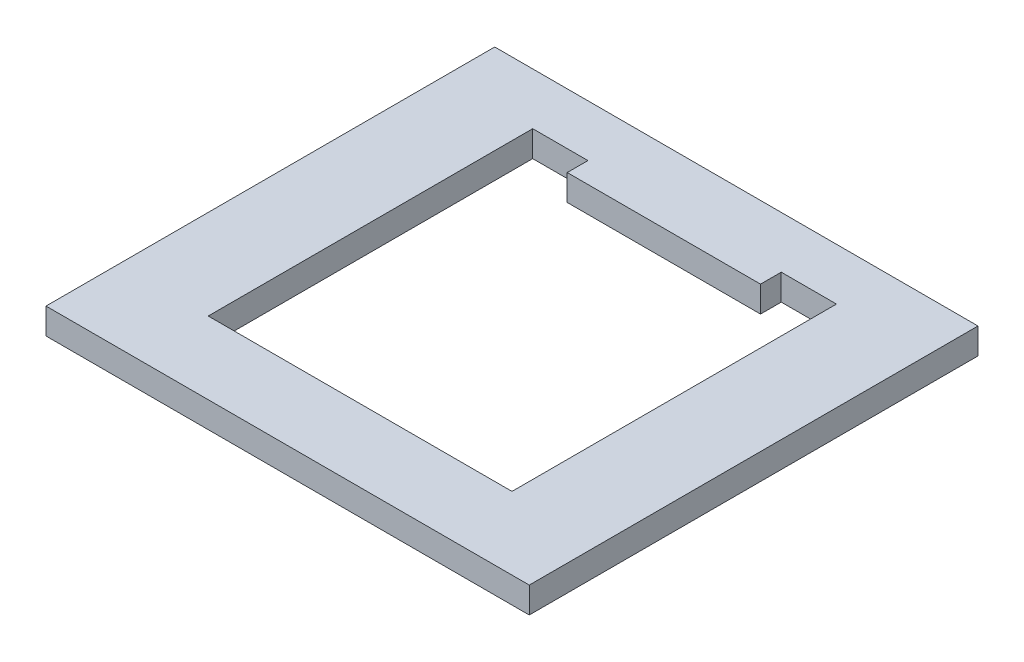
ISO-10303-21;
HEADER;
FILE_DESCRIPTION(('STEP AP214'),'2;1');
FILE_NAME('part.step','',(''),(''),'','','');
FILE_SCHEMA(('AUTOMOTIVE_DESIGN { 1 0 10303 214 1 1 1 1 }'));
ENDSEC;
DATA;
#1=APPLICATION_CONTEXT('core data for automotive mechanical design processes');
#2=APPLICATION_PROTOCOL_DEFINITION('international standard','automotive_design',2000,#1);
#3=PRODUCT_CONTEXT('',#1,'mechanical');
#4=PRODUCT('Part','Part','',(#3));
#5=PRODUCT_RELATED_PRODUCT_CATEGORY('part','',(#4));
#6=PRODUCT_DEFINITION_FORMATION('','',#4);
#7=PRODUCT_DEFINITION_CONTEXT('part definition',#1,'design');
#8=PRODUCT_DEFINITION('design','',#6,#7);
#9=PRODUCT_DEFINITION_SHAPE('','',#8);
#10=(LENGTH_UNIT() NAMED_UNIT(*) SI_UNIT(.MILLI.,.METRE.));
#11=(NAMED_UNIT(*) PLANE_ANGLE_UNIT() SI_UNIT($,.RADIAN.));
#12=(NAMED_UNIT(*) SI_UNIT($,.STERADIAN.) SOLID_ANGLE_UNIT());
#13=UNCERTAINTY_MEASURE_WITH_UNIT(LENGTH_MEASURE(1.E-05),#10,'distance_accuracy_value','');
#14=(GEOMETRIC_REPRESENTATION_CONTEXT(3) GLOBAL_UNCERTAINTY_ASSIGNED_CONTEXT((#13)) GLOBAL_UNIT_ASSIGNED_CONTEXT((#10,
#11,#12)) REPRESENTATION_CONTEXT('',''));
#15=CARTESIAN_POINT('',(0.,0.,0.));
#16=DIRECTION('',(0.,0.,1.));
#17=DIRECTION('',(1.,0.,0.));
#18=AXIS2_PLACEMENT_3D('',#15,#16,#17);
#19=CARTESIAN_POINT('',(35.,3.76,0.));
#20=DIRECTION('',(1.,0.,0.));
#21=DIRECTION('',(0.,0.,-1.));
#22=AXIS2_PLACEMENT_3D('',#19,#20,#21);
#23=PLANE('',#22);
#24=DIRECTION('',(0.,0.,1.));
#25=VECTOR('',#24,1.);
#26=CARTESIAN_POINT('',(35.,0.,0.));
#27=LINE('',#26,#25);
#28=CARTESIAN_POINT('',(35.,0.,-32.5));
#29=VERTEX_POINT('',#28);
#30=CARTESIAN_POINT('',(35.,0.,32.5));
#31=VERTEX_POINT('',#30);
#32=EDGE_CURVE('E184',#29,#31,#27,.T.);
#33=ORIENTED_EDGE('',*,*,#32,.F.);
#34=DIRECTION('',(0.,-1.,0.));
#35=VECTOR('',#34,1.);
#36=CARTESIAN_POINT('',(35.,3.76,-32.5));
#37=LINE('',#36,#35);
#38=CARTESIAN_POINT('',(35.,3.76,-32.5));
#39=VERTEX_POINT('',#38);
#40=EDGE_CURVE('E11',#39,#29,#37,.T.);
#41=ORIENTED_EDGE('',*,*,#40,.F.);
#42=DIRECTION('',(0.,0.,1.));
#43=VECTOR('',#42,1.);
#44=CARTESIAN_POINT('',(35.,3.76,0.));
#45=LINE('',#44,#43);
#46=CARTESIAN_POINT('',(35.,3.76,32.5));
#47=VERTEX_POINT('',#46);
#48=EDGE_CURVE('E154',#39,#47,#45,.T.);
#49=ORIENTED_EDGE('',*,*,#48,.T.);
#50=DIRECTION('',(0.,-1.,0.));
#51=VECTOR('',#50,1.);
#52=CARTESIAN_POINT('',(35.,3.76,32.5));
#53=LINE('',#52,#51);
#54=EDGE_CURVE('E104',#47,#31,#53,.T.);
#55=ORIENTED_EDGE('',*,*,#54,.T.);
#56=EDGE_LOOP('',(#33,#41,#49,#55));
#57=FACE_BOUND('',#56,.T.);
#58=ADVANCED_FACE('F38',(#57),#23,.T.);
#59=CARTESIAN_POINT('',(0.,3.76,-32.5));
#60=DIRECTION('',(0.,0.,-1.));
#61=DIRECTION('',(-1.,0.,0.));
#62=AXIS2_PLACEMENT_3D('',#59,#60,#61);
#63=PLANE('',#62);
#64=DIRECTION('',(1.,0.,0.));
#65=VECTOR('',#64,1.);
#66=CARTESIAN_POINT('',(0.,0.,-32.5));
#67=LINE('',#66,#65);
#68=CARTESIAN_POINT('',(-35.,0.,-32.5));
#69=VERTEX_POINT('',#68);
#70=EDGE_CURVE('E144',#69,#29,#67,.T.);
#71=ORIENTED_EDGE('',*,*,#70,.F.);
#72=DIRECTION('',(0.,-1.,0.));
#73=VECTOR('',#72,1.);
#74=CARTESIAN_POINT('',(-35.,3.76,-32.5));
#75=LINE('',#74,#73);
#76=CARTESIAN_POINT('',(-35.,3.76,-32.5));
#77=VERTEX_POINT('',#76);
#78=EDGE_CURVE('E48',#77,#69,#75,.T.);
#79=ORIENTED_EDGE('',*,*,#78,.F.);
#80=DIRECTION('',(1.,0.,0.));
#81=VECTOR('',#80,1.);
#82=CARTESIAN_POINT('',(0.,3.76,-32.5));
#83=LINE('',#82,#81);
#84=EDGE_CURVE('E142',#77,#39,#83,.T.);
#85=ORIENTED_EDGE('',*,*,#84,.T.);
#86=ORIENTED_EDGE('',*,*,#40,.T.);
#87=EDGE_LOOP('',(#71,#79,#85,#86));
#88=FACE_BOUND('',#87,.T.);
#89=ADVANCED_FACE('F140',(#88),#63,.T.);
#90=CARTESIAN_POINT('',(-35.,3.76,0.));
#91=DIRECTION('',(1.,0.,0.));
#92=DIRECTION('',(0.,0.,-1.));
#93=AXIS2_PLACEMENT_3D('',#90,#91,#92);
#94=PLANE('',#93);
#95=DIRECTION('',(0.,0.,1.));
#96=VECTOR('',#95,1.);
#97=CARTESIAN_POINT('',(-35.,0.,0.));
#98=LINE('',#97,#96);
#99=CARTESIAN_POINT('',(-35.,0.,32.5));
#100=VERTEX_POINT('',#99);
#101=EDGE_CURVE('E187',#69,#100,#98,.T.);
#102=ORIENTED_EDGE('',*,*,#101,.T.);
#103=DIRECTION('',(0.,-1.,0.));
#104=VECTOR('',#103,1.);
#105=CARTESIAN_POINT('',(-35.,3.76,32.5));
#106=LINE('',#105,#104);
#107=CARTESIAN_POINT('',(-35.,3.76,32.5));
#108=VERTEX_POINT('',#107);
#109=EDGE_CURVE('E147',#108,#100,#106,.T.);
#110=ORIENTED_EDGE('',*,*,#109,.F.);
#111=DIRECTION('',(0.,0.,1.));
#112=VECTOR('',#111,1.);
#113=CARTESIAN_POINT('',(-35.,3.76,0.));
#114=LINE('',#113,#112);
#115=EDGE_CURVE('E150',#77,#108,#114,.T.);
#116=ORIENTED_EDGE('',*,*,#115,.F.);
#117=ORIENTED_EDGE('',*,*,#78,.T.);
#118=EDGE_LOOP('',(#102,#110,#116,#117));
#119=FACE_BOUND('',#118,.T.);
#120=ADVANCED_FACE('F151',(#119),#94,.F.);
#121=CARTESIAN_POINT('',(14.,3.76,0.));
#122=DIRECTION('',(1.,0.,0.));
#123=DIRECTION('',(0.,0.,-1.));
#124=AXIS2_PLACEMENT_3D('',#121,#122,#123);
#125=PLANE('',#124);
#126=DIRECTION('',(0.,0.,1.));
#127=VECTOR('',#126,1.);
#128=CARTESIAN_POINT('',(14.,0.,0.));
#129=LINE('',#128,#127);
#130=CARTESIAN_POINT('',(14.,0.,-25.));
#131=VERTEX_POINT('',#130);
#132=CARTESIAN_POINT('',(14.,0.,-22.));
#133=VERTEX_POINT('',#132);
#134=EDGE_CURVE('E162',#131,#133,#129,.T.);
#135=ORIENTED_EDGE('',*,*,#134,.F.);
#136=DIRECTION('',(0.,-1.,0.));
#137=VECTOR('',#136,1.);
#138=CARTESIAN_POINT('',(14.,3.76,-25.));
#139=LINE('',#138,#137);
#140=CARTESIAN_POINT('',(14.,3.76,-25.));
#141=VERTEX_POINT('',#140);
#142=EDGE_CURVE('E42',#141,#131,#139,.T.);
#143=ORIENTED_EDGE('',*,*,#142,.F.);
#144=DIRECTION('',(0.,0.,1.));
#145=VECTOR('',#144,1.);
#146=CARTESIAN_POINT('',(14.,3.76,0.));
#147=LINE('',#146,#145);
#148=CARTESIAN_POINT('',(14.,3.76,-22.));
#149=VERTEX_POINT('',#148);
#150=EDGE_CURVE('E190',#141,#149,#147,.T.);
#151=ORIENTED_EDGE('',*,*,#150,.T.);
#152=DIRECTION('',(0.,-1.,0.));
#153=VECTOR('',#152,1.);
#154=CARTESIAN_POINT('',(14.,3.76,-22.));
#155=LINE('',#154,#153);
#156=EDGE_CURVE('E161',#149,#133,#155,.T.);
#157=ORIENTED_EDGE('',*,*,#156,.T.);
#158=EDGE_LOOP('',(#135,#143,#151,#157));
#159=FACE_BOUND('',#158,.T.);
#160=ADVANCED_FACE('F40',(#159),#125,.T.);
#161=CARTESIAN_POINT('',(0.,3.76,-25.));
#162=DIRECTION('',(0.,0.,1.));
#163=DIRECTION('',(1.,0.,0.));
#164=AXIS2_PLACEMENT_3D('',#161,#162,#163);
#165=PLANE('',#164);
#166=DIRECTION('',(-1.,0.,0.));
#167=VECTOR('',#166,1.);
#168=CARTESIAN_POINT('',(0.,0.,-25.));
#169=LINE('',#168,#167);
#170=CARTESIAN_POINT('',(22.,0.,-25.));
#171=VERTEX_POINT('',#170);
#172=EDGE_CURVE('E165',#171,#131,#169,.T.);
#173=ORIENTED_EDGE('',*,*,#172,.F.);
#174=DIRECTION('',(0.,-1.,0.));
#175=VECTOR('',#174,1.);
#176=CARTESIAN_POINT('',(22.,3.76,-25.));
#177=LINE('',#176,#175);
#178=CARTESIAN_POINT('',(22.,3.76,-25.));
#179=VERTEX_POINT('',#178);
#180=EDGE_CURVE('E205',#179,#171,#177,.T.);
#181=ORIENTED_EDGE('',*,*,#180,.F.);
#182=DIRECTION('',(-1.,0.,0.));
#183=VECTOR('',#182,1.);
#184=CARTESIAN_POINT('',(0.,3.76,-25.));
#185=LINE('',#184,#183);
#186=EDGE_CURVE('E214',#179,#141,#185,.T.);
#187=ORIENTED_EDGE('',*,*,#186,.T.);
#188=ORIENTED_EDGE('',*,*,#142,.T.);
#189=EDGE_LOOP('',(#173,#181,#187,#188));
#190=FACE_BOUND('',#189,.T.);
#191=ADVANCED_FACE('F212',(#190),#165,.T.);
#192=CARTESIAN_POINT('',(22.,3.76,0.));
#193=DIRECTION('',(-1.,0.,0.));
#194=DIRECTION('',(0.,0.,1.));
#195=AXIS2_PLACEMENT_3D('',#192,#193,#194);
#196=PLANE('',#195);
#197=DIRECTION('',(0.,0.,-1.));
#198=VECTOR('',#197,1.);
#199=CARTESIAN_POINT('',(22.,0.,0.));
#200=LINE('',#199,#198);
#201=CARTESIAN_POINT('',(22.,0.,22.));
#202=VERTEX_POINT('',#201);
#203=EDGE_CURVE('E168',#202,#171,#200,.T.);
#204=ORIENTED_EDGE('',*,*,#203,.F.);
#205=DIRECTION('',(0.,-1.,0.));
#206=VECTOR('',#205,1.);
#207=CARTESIAN_POINT('',(22.,3.76,22.));
#208=LINE('',#207,#206);
#209=CARTESIAN_POINT('',(22.,3.76,22.));
#210=VERTEX_POINT('',#209);
#211=EDGE_CURVE('E204',#210,#202,#208,.T.);
#212=ORIENTED_EDGE('',*,*,#211,.F.);
#213=DIRECTION('',(0.,0.,-1.));
#214=VECTOR('',#213,1.);
#215=CARTESIAN_POINT('',(22.,3.76,0.));
#216=LINE('',#215,#214);
#217=EDGE_CURVE('E222',#210,#179,#216,.T.);
#218=ORIENTED_EDGE('',*,*,#217,.T.);
#219=ORIENTED_EDGE('',*,*,#180,.T.);
#220=EDGE_LOOP('',(#204,#212,#218,#219));
#221=FACE_BOUND('',#220,.T.);
#222=ADVANCED_FACE('F220',(#221),#196,.T.);
#223=CARTESIAN_POINT('',(0.,3.76,22.));
#224=DIRECTION('',(0.,0.,-1.));
#225=DIRECTION('',(-1.,0.,0.));
#226=AXIS2_PLACEMENT_3D('',#223,#224,#225);
#227=PLANE('',#226);
#228=DIRECTION('',(1.,0.,0.));
#229=VECTOR('',#228,1.);
#230=CARTESIAN_POINT('',(0.,0.,22.));
#231=LINE('',#230,#229);
#232=CARTESIAN_POINT('',(-22.,0.,22.));
#233=VERTEX_POINT('',#232);
#234=EDGE_CURVE('E171',#233,#202,#231,.T.);
#235=ORIENTED_EDGE('',*,*,#234,.F.);
#236=DIRECTION('',(0.,-1.,0.));
#237=VECTOR('',#236,1.);
#238=CARTESIAN_POINT('',(-22.,3.76,22.));
#239=LINE('',#238,#237);
#240=CARTESIAN_POINT('',(-22.,3.76,22.));
#241=VERTEX_POINT('',#240);
#242=EDGE_CURVE('E202',#241,#233,#239,.T.);
#243=ORIENTED_EDGE('',*,*,#242,.F.);
#244=DIRECTION('',(1.,0.,0.));
#245=VECTOR('',#244,1.);
#246=CARTESIAN_POINT('',(0.,3.76,22.));
#247=LINE('',#246,#245);
#248=EDGE_CURVE('E228',#241,#210,#247,.T.);
#249=ORIENTED_EDGE('',*,*,#248,.T.);
#250=ORIENTED_EDGE('',*,*,#211,.T.);
#251=EDGE_LOOP('',(#235,#243,#249,#250));
#252=FACE_BOUND('',#251,.T.);
#253=ADVANCED_FACE('F231',(#252),#227,.T.);
#254=CARTESIAN_POINT('',(-22.,3.76,0.));
#255=DIRECTION('',(1.,0.,0.));
#256=DIRECTION('',(0.,0.,-1.));
#257=AXIS2_PLACEMENT_3D('',#254,#255,#256);
#258=PLANE('',#257);
#259=DIRECTION('',(0.,0.,1.));
#260=VECTOR('',#259,1.);
#261=CARTESIAN_POINT('',(-22.,0.,0.));
#262=LINE('',#261,#260);
#263=CARTESIAN_POINT('',(-22.,0.,-25.));
#264=VERTEX_POINT('',#263);
#265=EDGE_CURVE('E174',#264,#233,#262,.T.);
#266=ORIENTED_EDGE('',*,*,#265,.F.);
#267=DIRECTION('',(0.,-1.,0.));
#268=VECTOR('',#267,1.);
#269=CARTESIAN_POINT('',(-22.,3.76,-25.));
#270=LINE('',#269,#268);
#271=CARTESIAN_POINT('',(-22.,3.76,-25.));
#272=VERTEX_POINT('',#271);
#273=EDGE_CURVE('E200',#272,#264,#270,.T.);
#274=ORIENTED_EDGE('',*,*,#273,.F.);
#275=DIRECTION('',(0.,0.,1.));
#276=VECTOR('',#275,1.);
#277=CARTESIAN_POINT('',(-22.,3.76,0.));
#278=LINE('',#277,#276);
#279=EDGE_CURVE('E232',#272,#241,#278,.T.);
#280=ORIENTED_EDGE('',*,*,#279,.T.);
#281=ORIENTED_EDGE('',*,*,#242,.T.);
#282=EDGE_LOOP('',(#266,#274,#280,#281));
#283=FACE_BOUND('',#282,.T.);
#284=ADVANCED_FACE('F256',(#283),#258,.T.);
#285=CARTESIAN_POINT('',(0.,3.76,-25.));
#286=DIRECTION('',(0.,0.,-1.));
#287=DIRECTION('',(-1.,0.,0.));
#288=AXIS2_PLACEMENT_3D('',#285,#286,#287);
#289=PLANE('',#288);
#290=DIRECTION('',(1.,0.,0.));
#291=VECTOR('',#290,1.);
#292=CARTESIAN_POINT('',(0.,0.,-25.));
#293=LINE('',#292,#291);
#294=CARTESIAN_POINT('',(-14.,0.,-25.));
#295=VERTEX_POINT('',#294);
#296=EDGE_CURVE('E177',#264,#295,#293,.T.);
#297=ORIENTED_EDGE('',*,*,#296,.T.);
#298=DIRECTION('',(0.,-1.,0.));
#299=VECTOR('',#298,1.);
#300=CARTESIAN_POINT('',(-14.,3.76,-25.));
#301=LINE('',#300,#299);
#302=CARTESIAN_POINT('',(-14.,3.76,-25.));
#303=VERTEX_POINT('',#302);
#304=EDGE_CURVE('E197',#303,#295,#301,.T.);
#305=ORIENTED_EDGE('',*,*,#304,.F.);
#306=DIRECTION('',(1.,0.,0.));
#307=VECTOR('',#306,1.);
#308=CARTESIAN_POINT('',(0.,3.76,-25.));
#309=LINE('',#308,#307);
#310=EDGE_CURVE('E234',#272,#303,#309,.T.);
#311=ORIENTED_EDGE('',*,*,#310,.F.);
#312=ORIENTED_EDGE('',*,*,#273,.T.);
#313=EDGE_LOOP('',(#297,#305,#311,#312));
#314=FACE_BOUND('',#313,.T.);
#315=ADVANCED_FACE('F254',(#314),#289,.F.);
#316=CARTESIAN_POINT('',(-14.,3.76,0.));
#317=DIRECTION('',(1.,0.,0.));
#318=DIRECTION('',(0.,0.,-1.));
#319=AXIS2_PLACEMENT_3D('',#316,#317,#318);
#320=PLANE('',#319);
#321=DIRECTION('',(0.,0.,1.));
#322=VECTOR('',#321,1.);
#323=CARTESIAN_POINT('',(-14.,0.,0.));
#324=LINE('',#323,#322);
#325=CARTESIAN_POINT('',(-14.,0.,-22.));
#326=VERTEX_POINT('',#325);
#327=EDGE_CURVE('E179',#295,#326,#324,.T.);
#328=ORIENTED_EDGE('',*,*,#327,.T.);
#329=DIRECTION('',(0.,-1.,0.));
#330=VECTOR('',#329,1.);
#331=CARTESIAN_POINT('',(-14.,3.76,-22.));
#332=LINE('',#331,#330);
#333=CARTESIAN_POINT('',(-14.,3.76,-22.));
#334=VERTEX_POINT('',#333);
#335=EDGE_CURVE('E194',#334,#326,#332,.T.);
#336=ORIENTED_EDGE('',*,*,#335,.F.);
#337=DIRECTION('',(0.,0.,1.));
#338=VECTOR('',#337,1.);
#339=CARTESIAN_POINT('',(-14.,3.76,0.));
#340=LINE('',#339,#338);
#341=EDGE_CURVE('E239',#303,#334,#340,.T.);
#342=ORIENTED_EDGE('',*,*,#341,.F.);
#343=ORIENTED_EDGE('',*,*,#304,.T.);
#344=EDGE_LOOP('',(#328,#336,#342,#343));
#345=FACE_BOUND('',#344,.T.);
#346=ADVANCED_FACE('F250',(#345),#320,.F.);
#347=CARTESIAN_POINT('',(0.,3.76,-22.));
#348=DIRECTION('',(0.,0.,-1.));
#349=DIRECTION('',(-1.,0.,0.));
#350=AXIS2_PLACEMENT_3D('',#347,#348,#349);
#351=PLANE('',#350);
#352=DIRECTION('',(1.,0.,0.));
#353=VECTOR('',#352,1.);
#354=CARTESIAN_POINT('',(0.,0.,-22.));
#355=LINE('',#354,#353);
#356=EDGE_CURVE('E181',#326,#133,#355,.T.);
#357=ORIENTED_EDGE('',*,*,#356,.T.);
#358=ORIENTED_EDGE('',*,*,#156,.F.);
#359=DIRECTION('',(1.,0.,0.));
#360=VECTOR('',#359,1.);
#361=CARTESIAN_POINT('',(0.,3.76,-22.));
#362=LINE('',#361,#360);
#363=EDGE_CURVE('E156',#334,#149,#362,.T.);
#364=ORIENTED_EDGE('',*,*,#363,.F.);
#365=ORIENTED_EDGE('',*,*,#335,.T.);
#366=EDGE_LOOP('',(#357,#358,#364,#365));
#367=FACE_BOUND('',#366,.T.);
#368=ADVANCED_FACE('F244',(#367),#351,.F.);
#369=CARTESIAN_POINT('',(0.,3.76,32.5));
#370=DIRECTION('',(0.,0.,-1.));
#371=DIRECTION('',(-1.,0.,0.));
#372=AXIS2_PLACEMENT_3D('',#369,#370,#371);
#373=PLANE('',#372);
#374=DIRECTION('',(1.,0.,0.));
#375=VECTOR('',#374,1.);
#376=CARTESIAN_POINT('',(0.,0.,32.5));
#377=LINE('',#376,#375);
#378=EDGE_CURVE('E97',#100,#31,#377,.T.);
#379=ORIENTED_EDGE('',*,*,#378,.T.);
#380=ORIENTED_EDGE('',*,*,#54,.F.);
#381=DIRECTION('',(1.,0.,0.));
#382=VECTOR('',#381,1.);
#383=CARTESIAN_POINT('',(0.,3.76,32.5));
#384=LINE('',#383,#382);
#385=EDGE_CURVE('E57',#108,#47,#384,.T.);
#386=ORIENTED_EDGE('',*,*,#385,.F.);
#387=ORIENTED_EDGE('',*,*,#109,.T.);
#388=EDGE_LOOP('',(#379,#380,#386,#387));
#389=FACE_BOUND('',#388,.T.);
#390=ADVANCED_FACE('F275',(#389),#373,.F.);
#391=CARTESIAN_POINT('',(0.,3.76,0.));
#392=DIRECTION('',(0.,1.,0.));
#393=DIRECTION('',(0.,0.,1.));
#394=AXIS2_PLACEMENT_3D('',#391,#392,#393);
#395=PLANE('',#394);
#396=ORIENTED_EDGE('',*,*,#150,.F.);
#397=ORIENTED_EDGE('',*,*,#186,.F.);
#398=ORIENTED_EDGE('',*,*,#217,.F.);
#399=ORIENTED_EDGE('',*,*,#248,.F.);
#400=ORIENTED_EDGE('',*,*,#279,.F.);
#401=ORIENTED_EDGE('',*,*,#310,.T.);
#402=ORIENTED_EDGE('',*,*,#341,.T.);
#403=ORIENTED_EDGE('',*,*,#363,.T.);
#404=EDGE_LOOP('',(#396,#397,#398,#399,#400,#401,#402,#403));
#405=FACE_BOUND('',#404,.T.);
#406=ORIENTED_EDGE('',*,*,#48,.F.);
#407=ORIENTED_EDGE('',*,*,#84,.F.);
#408=ORIENTED_EDGE('',*,*,#115,.T.);
#409=ORIENTED_EDGE('',*,*,#385,.T.);
#410=EDGE_LOOP('',(#406,#407,#408,#409));
#411=FACE_BOUND('',#410,.T.);
#412=ADVANCED_FACE('F153',(#405,#411),#395,.T.);
#413=CARTESIAN_POINT('',(0.,0.,0.));
#414=DIRECTION('',(0.,1.,0.));
#415=DIRECTION('',(0.,0.,1.));
#416=AXIS2_PLACEMENT_3D('',#413,#414,#415);
#417=PLANE('',#416);
#418=ORIENTED_EDGE('',*,*,#134,.T.);
#419=ORIENTED_EDGE('',*,*,#356,.F.);
#420=ORIENTED_EDGE('',*,*,#327,.F.);
#421=ORIENTED_EDGE('',*,*,#296,.F.);
#422=ORIENTED_EDGE('',*,*,#265,.T.);
#423=ORIENTED_EDGE('',*,*,#234,.T.);
#424=ORIENTED_EDGE('',*,*,#203,.T.);
#425=ORIENTED_EDGE('',*,*,#172,.T.);
#426=EDGE_LOOP('',(#418,#419,#420,#421,#422,#423,#424,#425));
#427=FACE_BOUND('',#426,.T.);
#428=ORIENTED_EDGE('',*,*,#32,.T.);
#429=ORIENTED_EDGE('',*,*,#378,.F.);
#430=ORIENTED_EDGE('',*,*,#101,.F.);
#431=ORIENTED_EDGE('',*,*,#70,.T.);
#432=EDGE_LOOP('',(#428,#429,#430,#431));
#433=FACE_BOUND('',#432,.T.);
#434=ADVANCED_FACE('F218',(#427,#433),#417,.F.);
#435=CLOSED_SHELL('',(#58,#89,#120,#160,#191,#222,#253,#284,#315,#346,#368,#390,#412,#434));
#436=MANIFOLD_SOLID_BREP('B2',#435);
#437=ADVANCED_BREP_SHAPE_REPRESENTATION('',(#18,#436),#14);
#438=SHAPE_DEFINITION_REPRESENTATION(#9,#437);
ENDSEC;
END-ISO-10303-21;
